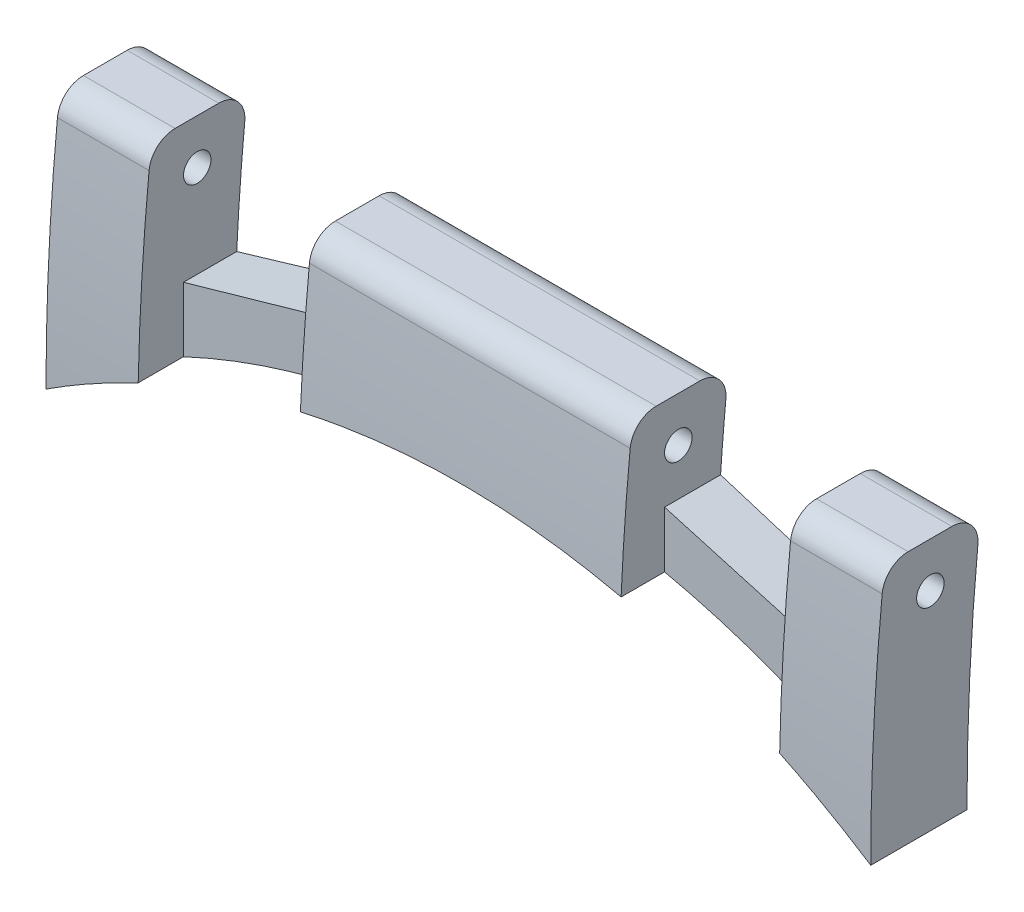
ISO-10303-21;
HEADER;
FILE_DESCRIPTION(('STEP AP214'),'2;1');
FILE_NAME('part.step','',(''),(''),'','','');
FILE_SCHEMA(('AUTOMOTIVE_DESIGN { 1 0 10303 214 1 1 1 1 }'));
ENDSEC;
DATA;
#1=APPLICATION_CONTEXT('core data for automotive mechanical design processes');
#2=APPLICATION_PROTOCOL_DEFINITION('international standard','automotive_design',2000,#1);
#3=PRODUCT_CONTEXT('',#1,'mechanical');
#4=PRODUCT('Part','Part','',(#3));
#5=PRODUCT_RELATED_PRODUCT_CATEGORY('part','',(#4));
#6=PRODUCT_DEFINITION_FORMATION('','',#4);
#7=PRODUCT_DEFINITION_CONTEXT('part definition',#1,'design');
#8=PRODUCT_DEFINITION('design','',#6,#7);
#9=PRODUCT_DEFINITION_SHAPE('','',#8);
#10=(LENGTH_UNIT() NAMED_UNIT(*) SI_UNIT(.MILLI.,.METRE.));
#11=(NAMED_UNIT(*) PLANE_ANGLE_UNIT() SI_UNIT($,.RADIAN.));
#12=(NAMED_UNIT(*) SI_UNIT($,.STERADIAN.) SOLID_ANGLE_UNIT());
#13=UNCERTAINTY_MEASURE_WITH_UNIT(LENGTH_MEASURE(1.E-05),#10,'distance_accuracy_value','');
#14=(GEOMETRIC_REPRESENTATION_CONTEXT(3) GLOBAL_UNCERTAINTY_ASSIGNED_CONTEXT((#13)) GLOBAL_UNIT_ASSIGNED_CONTEXT((#10,
#11,#12)) REPRESENTATION_CONTEXT('',''));
#15=CARTESIAN_POINT('',(0.,0.,0.));
#16=DIRECTION('',(0.,0.,1.));
#17=DIRECTION('',(1.,0.,0.));
#18=AXIS2_PLACEMENT_3D('',#15,#16,#17);
#19=CARTESIAN_POINT('',(12.5,5.99999999999999,5.));
#20=DIRECTION('',(-0.274721127897377,-0.961523947640823,0.));
#21=DIRECTION('',(0.961523947640823,-0.274721127897377,0.));
#22=AXIS2_PLACEMENT_3D('',#19,#20,#21);
#23=PLANE('',#22);
#24=DIRECTION('',(-0.961523947640823,0.274721127897377,0.));
#25=VECTOR('',#24,1.);
#26=CARTESIAN_POINT('',(12.5,5.99999999999999,2.1));
#27=LINE('',#26,#25);
#28=CARTESIAN_POINT('',(16.,5.,2.1));
#29=VERTEX_POINT('',#28);
#30=CARTESIAN_POINT('',(12.5,5.99999999999999,2.1));
#31=VERTEX_POINT('',#30);
#32=EDGE_CURVE('E192',#29,#31,#27,.T.);
#33=ORIENTED_EDGE('',*,*,#32,.F.);
#34=DIRECTION('',(0.,0.,-1.));
#35=VECTOR('',#34,1.);
#36=CARTESIAN_POINT('',(16.,5.,5.));
#37=LINE('',#36,#35);
#38=CARTESIAN_POINT('',(16.,5.,0.937460888595472));
#39=VERTEX_POINT('',#38);
#40=EDGE_CURVE('E211',#29,#39,#37,.T.);
#41=ORIENTED_EDGE('',*,*,#40,.T.);
#42=CARTESIAN_POINT('',(24.75,2.5,-49.));
#43=DIRECTION('',(-0.274721127897377,-0.961523947640823,0.));
#44=DIRECTION('',(-0.961523947640823,0.274721127897377,0.));
#45=AXIS2_PLACEMENT_3D('',#42,#43,#44);
#46=ELLIPSE('',#45,182.002747232014,50.);
#47=CARTESIAN_POINT('',(12.5,5.99999999999999,0.87734956871708));
#48=VERTEX_POINT('',#47);
#49=EDGE_CURVE('E210',#48,#39,#46,.F.);
#50=ORIENTED_EDGE('',*,*,#49,.F.);
#51=DIRECTION('',(0.,0.,-1.));
#52=VECTOR('',#51,1.);
#53=CARTESIAN_POINT('',(12.5,5.99999999999999,5.));
#54=LINE('',#53,#52);
#55=EDGE_CURVE('E205',#31,#48,#54,.T.);
#56=ORIENTED_EDGE('',*,*,#55,.F.);
#57=EDGE_LOOP('',(#33,#41,#50,#56));
#58=FACE_BOUND('',#57,.T.);
#59=ADVANCED_FACE('F36',(#58),#23,.F.);
#60=CARTESIAN_POINT('',(2.,5.,5.));
#61=DIRECTION('',(0.274721127897376,-0.961523947640824,0.));
#62=DIRECTION('',(0.961523947640824,0.274721127897376,0.));
#63=AXIS2_PLACEMENT_3D('',#60,#61,#62);
#64=PLANE('',#63);
#65=DIRECTION('',(-0.961523947640824,-0.274721127897376,0.));
#66=VECTOR('',#65,1.);
#67=CARTESIAN_POINT('',(2.,5.,2.1));
#68=LINE('',#67,#66);
#69=CARTESIAN_POINT('',(5.5,5.99999999999999,2.1));
#70=VERTEX_POINT('',#69);
#71=CARTESIAN_POINT('',(2.,5.,2.1));
#72=VERTEX_POINT('',#71);
#73=EDGE_CURVE('E499',#70,#72,#68,.T.);
#74=ORIENTED_EDGE('',*,*,#73,.F.);
#75=DIRECTION('',(0.,0.,-1.));
#76=VECTOR('',#75,1.);
#77=CARTESIAN_POINT('',(5.5,5.99999999999999,5.));
#78=LINE('',#77,#76);
#79=CARTESIAN_POINT('',(5.5,5.99999999999999,0.877349568717096));
#80=VERTEX_POINT('',#79);
#81=EDGE_CURVE('E438',#70,#80,#78,.T.);
#82=ORIENTED_EDGE('',*,*,#81,.T.);
#83=CARTESIAN_POINT('',(-6.75000000000007,2.5,-49.));
#84=DIRECTION('',(0.274721127897376,-0.961523947640824,0.));
#85=DIRECTION('',(-0.961523947640824,-0.274721127897376,0.));
#86=AXIS2_PLACEMENT_3D('',#83,#84,#85);
#87=ELLIPSE('',#86,182.002747232014,50.);
#88=CARTESIAN_POINT('',(2.,5.,0.937460888595469));
#89=VERTEX_POINT('',#88);
#90=EDGE_CURVE('E412',#89,#80,#87,.F.);
#91=ORIENTED_EDGE('',*,*,#90,.F.);
#92=DIRECTION('',(0.,0.,-1.));
#93=VECTOR('',#92,1.);
#94=CARTESIAN_POINT('',(2.,5.,5.));
#95=LINE('',#94,#93);
#96=EDGE_CURVE('E436',#72,#89,#95,.T.);
#97=ORIENTED_EDGE('',*,*,#96,.F.);
#98=EDGE_LOOP('',(#74,#82,#91,#97));
#99=FACE_BOUND('',#98,.T.);
#100=ADVANCED_FACE('F345',(#99),#64,.F.);
#101=CARTESIAN_POINT('',(18.,8.,5.));
#102=DIRECTION('',(-1.,0.,0.));
#103=DIRECTION('',(0.,-1.,0.));
#104=AXIS2_PLACEMENT_3D('',#101,#102,#103);
#105=PLANE('',#104);
#106=CARTESIAN_POINT('',(18.,7.02,1.79930708188843));
#107=DIRECTION('',(1.,0.,0.));
#108=DIRECTION('',(0.,0.,-1.));
#109=AXIS2_PLACEMENT_3D('',#106,#107,#108);
#110=CIRCLE('',#109,0.3);
#111=CARTESIAN_POINT('',(18.,7.02,1.49930708188843));
#112=VERTEX_POINT('',#111);
#113=EDGE_CURVE('E477',#112,#112,#110,.T.);
#114=ORIENTED_EDGE('',*,*,#113,.F.);
#115=EDGE_LOOP('',(#114));
#116=FACE_BOUND('',#115,.T.);
#117=DIRECTION('',(0.,0.,-1.));
#118=VECTOR('',#117,1.);
#119=CARTESIAN_POINT('',(18.,2.48042365578647,3.10000000000002));
#120=LINE('',#119,#118);
#121=CARTESIAN_POINT('',(18.,2.48042365578647,0.999996167667348));
#122=VERTEX_POINT('',#121);
#123=CARTESIAN_POINT('',(18.,2.48042365578647,3.09999616766735));
#124=VERTEX_POINT('',#123);
#125=EDGE_CURVE('E481',#122,#124,#120,.F.);
#126=ORIENTED_EDGE('',*,*,#125,.F.);
#127=CARTESIAN_POINT('',(18.,2.5,-49.));
#128=DIRECTION('',(-1.,0.,0.));
#129=DIRECTION('',(0.,-1.,0.));
#130=AXIS2_PLACEMENT_3D('',#127,#128,#129);
#131=CIRCLE('',#130,50.);
#132=CARTESIAN_POINT('',(18.,7.37443148111528,0.761831937097279));
#133=VERTEX_POINT('',#132);
#134=EDGE_CURVE('E430',#133,#122,#131,.F.);
#135=ORIENTED_EDGE('',*,*,#134,.F.);
#136=CARTESIAN_POINT('',(18.,7.43,1.32911682118018));
#137=DIRECTION('',(-1.,0.,0.));
#138=DIRECTION('',(0.,-1.,0.));
#139=AXIS2_PLACEMENT_3D('',#136,#137,#138);
#140=CIRCLE('',#139,0.57);
#141=CARTESIAN_POINT('',(18.,8.,1.32911682118018));
#142=VERTEX_POINT('',#141);
#143=EDGE_CURVE('E235',#133,#142,#140,.F.);
#144=ORIENTED_EDGE('',*,*,#143,.T.);
#145=DIRECTION('',(0.,0.,-1.));
#146=VECTOR('',#145,1.);
#147=CARTESIAN_POINT('',(18.,8.,5.));
#148=LINE('',#147,#146);
#149=CARTESIAN_POINT('',(18.,8.,2.28353382993135));
#150=VERTEX_POINT('',#149);
#151=EDGE_CURVE('E223',#150,#142,#148,.T.);
#152=ORIENTED_EDGE('',*,*,#151,.F.);
#153=CARTESIAN_POINT('',(18.,7.43,2.28353382993135));
#154=DIRECTION('',(-1.,0.,0.));
#155=DIRECTION('',(0.,-1.,0.));
#156=AXIS2_PLACEMENT_3D('',#153,#154,#155);
#157=CIRCLE('',#156,0.57);
#158=CARTESIAN_POINT('',(18.,7.48685009103783,2.85069171548791));
#159=VERTEX_POINT('',#158);
#160=EDGE_CURVE('E237',#150,#159,#157,.F.);
#161=ORIENTED_EDGE('',*,*,#160,.T.);
#162=CARTESIAN_POINT('',(18.,2.5,-46.9));
#163=DIRECTION('',(-1.,0.,0.));
#164=DIRECTION('',(0.,-1.,0.));
#165=AXIS2_PLACEMENT_3D('',#162,#163,#164);
#166=CIRCLE('',#165,50.);
#167=EDGE_CURVE('E410',#159,#124,#166,.F.);
#168=ORIENTED_EDGE('',*,*,#167,.T.);
#169=EDGE_LOOP('',(#126,#135,#144,#152,#161,#168));
#170=FACE_BOUND('',#169,.T.);
#171=ADVANCED_FACE('F348',(#116,#170),#105,.F.);
#172=CARTESIAN_POINT('',(16.,5.,5.));
#173=DIRECTION('',(1.,0.,0.));
#174=DIRECTION('',(0.,0.,-1.));
#175=AXIS2_PLACEMENT_3D('',#172,#173,#174);
#176=PLANE('',#175);
#177=CARTESIAN_POINT('',(16.,2.5,-46.9));
#178=DIRECTION('',(1.,0.,0.));
#179=DIRECTION('',(0.,0.,-1.));
#180=AXIS2_PLACEMENT_3D('',#177,#178,#179);
#181=CIRCLE('',#180,50.);
#182=CARTESIAN_POINT('',(16.,3.59265976733109,3.08805952057809));
#183=VERTEX_POINT('',#182);
#184=CARTESIAN_POINT('',(16.,7.48685009103783,2.85069171548791));
#185=VERTEX_POINT('',#184);
#186=EDGE_CURVE('E415',#183,#185,#181,.F.);
#187=ORIENTED_EDGE('',*,*,#186,.T.);
#188=CARTESIAN_POINT('',(16.,7.43,2.28353382993135));
#189=DIRECTION('',(1.,0.,0.));
#190=DIRECTION('',(0.,0.,-1.));
#191=AXIS2_PLACEMENT_3D('',#188,#189,#190);
#192=CIRCLE('',#191,0.57);
#193=CARTESIAN_POINT('',(16.,8.,2.28353382993135));
#194=VERTEX_POINT('',#193);
#195=EDGE_CURVE('E241',#185,#194,#192,.F.);
#196=ORIENTED_EDGE('',*,*,#195,.T.);
#197=DIRECTION('',(0.,0.,-1.));
#198=VECTOR('',#197,1.);
#199=CARTESIAN_POINT('',(16.,8.,5.));
#200=LINE('',#199,#198);
#201=CARTESIAN_POINT('',(16.,8.,1.32911682118018));
#202=VERTEX_POINT('',#201);
#203=EDGE_CURVE('E214',#194,#202,#200,.T.);
#204=ORIENTED_EDGE('',*,*,#203,.T.);
#205=CARTESIAN_POINT('',(16.,7.43,1.32911682118018));
#206=DIRECTION('',(1.,0.,0.));
#207=DIRECTION('',(0.,0.,-1.));
#208=AXIS2_PLACEMENT_3D('',#205,#206,#207);
#209=CIRCLE('',#208,0.57);
#210=CARTESIAN_POINT('',(16.,7.37443148111528,0.761831937097279));
#211=VERTEX_POINT('',#210);
#212=EDGE_CURVE('E239',#202,#211,#209,.F.);
#213=ORIENTED_EDGE('',*,*,#212,.T.);
#214=CARTESIAN_POINT('',(16.,2.5,-49.));
#215=DIRECTION('',(1.,0.,0.));
#216=DIRECTION('',(0.,0.,-1.));
#217=AXIS2_PLACEMENT_3D('',#214,#215,#216);
#218=CIRCLE('',#217,50.);
#219=EDGE_CURVE('E427',#39,#211,#218,.F.);
#220=ORIENTED_EDGE('',*,*,#219,.F.);
#221=ORIENTED_EDGE('',*,*,#40,.F.);
#222=DIRECTION('',(0.,1.,0.));
#223=VECTOR('',#222,1.);
#224=CARTESIAN_POINT('',(16.,6.68342568658216,2.1));
#225=LINE('',#224,#223);
#226=CARTESIAN_POINT('',(16.,3.59265976733109,2.1));
#227=VERTEX_POINT('',#226);
#228=EDGE_CURVE('E197',#227,#29,#225,.T.);
#229=ORIENTED_EDGE('',*,*,#228,.F.);
#230=DIRECTION('',(0.,0.,-1.));
#231=VECTOR('',#230,1.);
#232=CARTESIAN_POINT('',(16.,3.59265976733109,3.10000000000002));
#233=LINE('',#232,#231);
#234=EDGE_CURVE('E512',#183,#227,#233,.T.);
#235=ORIENTED_EDGE('',*,*,#234,.F.);
#236=EDGE_LOOP('',(#187,#196,#204,#213,#220,#221,#229,#235));
#237=FACE_BOUND('',#236,.T.);
#238=CARTESIAN_POINT('',(16.,7.02,1.79930708188843));
#239=DIRECTION('',(1.,0.,0.));
#240=DIRECTION('',(0.,0.,-1.));
#241=AXIS2_PLACEMENT_3D('',#238,#239,#240);
#242=CIRCLE('',#241,0.3);
#243=CARTESIAN_POINT('',(16.,7.02,1.49930708188843));
#244=VERTEX_POINT('',#243);
#245=EDGE_CURVE('E465',#244,#244,#242,.F.);
#246=ORIENTED_EDGE('',*,*,#245,.F.);
#247=EDGE_LOOP('',(#246));
#248=FACE_BOUND('',#247,.T.);
#249=ADVANCED_FACE('F359',(#237,#248),#176,.F.);
#250=CARTESIAN_POINT('',(12.5,7.99999999999999,5.));
#251=DIRECTION('',(-1.,0.,0.));
#252=DIRECTION('',(0.,-1.,0.));
#253=AXIS2_PLACEMENT_3D('',#250,#251,#252);
#254=PLANE('',#253);
#255=CARTESIAN_POINT('',(12.5,7.02,1.79930708188843));
#256=DIRECTION('',(-1.,0.,0.));
#257=DIRECTION('',(0.,-1.,0.));
#258=AXIS2_PLACEMENT_3D('',#255,#256,#257);
#259=CIRCLE('',#258,0.3);
#260=CARTESIAN_POINT('',(12.5,6.72,1.79930708188843));
#261=VERTEX_POINT('',#260);
#262=EDGE_CURVE('E468',#261,#261,#259,.F.);
#263=ORIENTED_EDGE('',*,*,#262,.F.);
#264=EDGE_LOOP('',(#263));
#265=FACE_BOUND('',#264,.T.);
#266=CARTESIAN_POINT('',(12.5,2.5,-46.9));
#267=DIRECTION('',(-1.,0.,0.));
#268=DIRECTION('',(0.,-1.,0.));
#269=AXIS2_PLACEMENT_3D('',#266,#267,#268);
#270=CIRCLE('',#269,50.);
#271=CARTESIAN_POINT('',(12.5,7.48685009103782,2.85069171548791));
#272=VERTEX_POINT('',#271);
#273=CARTESIAN_POINT('',(12.5,4.77562246644425,3.0481885796694));
#274=VERTEX_POINT('',#273);
#275=EDGE_CURVE('E451',#272,#274,#270,.F.);
#276=ORIENTED_EDGE('',*,*,#275,.T.);
#277=DIRECTION('',(0.,0.,-1.));
#278=VECTOR('',#277,1.);
#279=CARTESIAN_POINT('',(12.5,4.77562246644425,3.10000000000002));
#280=LINE('',#279,#278);
#281=CARTESIAN_POINT('',(12.5,4.77562246644425,2.1));
#282=VERTEX_POINT('',#281);
#283=EDGE_CURVE('E51',#282,#274,#280,.F.);
#284=ORIENTED_EDGE('',*,*,#283,.F.);
#285=DIRECTION('',(0.,-1.,0.));
#286=VECTOR('',#285,1.);
#287=CARTESIAN_POINT('',(12.5,6.68342568658216,2.1));
#288=LINE('',#287,#286);
#289=EDGE_CURVE('E195',#31,#282,#288,.T.);
#290=ORIENTED_EDGE('',*,*,#289,.F.);
#291=ORIENTED_EDGE('',*,*,#55,.T.);
#292=CARTESIAN_POINT('',(12.5,2.5,-49.));
#293=DIRECTION('',(-1.,0.,0.));
#294=DIRECTION('',(0.,-1.,0.));
#295=AXIS2_PLACEMENT_3D('',#292,#293,#294);
#296=CIRCLE('',#295,50.);
#297=CARTESIAN_POINT('',(12.5,7.37443148111528,0.761831937097279));
#298=VERTEX_POINT('',#297);
#299=EDGE_CURVE('E424',#298,#48,#296,.F.);
#300=ORIENTED_EDGE('',*,*,#299,.F.);
#301=CARTESIAN_POINT('',(12.5,7.42999999999999,1.32911682118018));
#302=DIRECTION('',(-1.,0.,0.));
#303=DIRECTION('',(0.,-1.,0.));
#304=AXIS2_PLACEMENT_3D('',#301,#302,#303);
#305=CIRCLE('',#304,0.57);
#306=CARTESIAN_POINT('',(12.5,7.99999999999999,1.32911682118018));
#307=VERTEX_POINT('',#306);
#308=EDGE_CURVE('E253',#298,#307,#305,.F.);
#309=ORIENTED_EDGE('',*,*,#308,.T.);
#310=DIRECTION('',(0.,0.,-1.));
#311=VECTOR('',#310,1.);
#312=CARTESIAN_POINT('',(12.5,7.99999999999999,5.));
#313=LINE('',#312,#311);
#314=CARTESIAN_POINT('',(12.5,7.99999999999999,2.28353382993135));
#315=VERTEX_POINT('',#314);
#316=EDGE_CURVE('E212',#315,#307,#313,.T.);
#317=ORIENTED_EDGE('',*,*,#316,.F.);
#318=CARTESIAN_POINT('',(12.5,7.42999999999999,2.28353382993135));
#319=DIRECTION('',(-1.,0.,0.));
#320=DIRECTION('',(0.,-1.,0.));
#321=AXIS2_PLACEMENT_3D('',#318,#319,#320);
#322=CIRCLE('',#321,0.57);
#323=EDGE_CURVE('E255',#315,#272,#322,.F.);
#324=ORIENTED_EDGE('',*,*,#323,.T.);
#325=EDGE_LOOP('',(#276,#284,#290,#291,#300,#309,#317,#324));
#326=FACE_BOUND('',#325,.T.);
#327=ADVANCED_FACE('F203',(#265,#326),#254,.F.);
#328=CARTESIAN_POINT('',(5.5,5.99999999999999,5.));
#329=DIRECTION('',(1.,0.,0.));
#330=DIRECTION('',(0.,0.,-1.));
#331=AXIS2_PLACEMENT_3D('',#328,#329,#330);
#332=PLANE('',#331);
#333=CARTESIAN_POINT('',(5.5,2.5,-46.9));
#334=DIRECTION('',(1.,0.,0.));
#335=DIRECTION('',(0.,0.,-1.));
#336=AXIS2_PLACEMENT_3D('',#333,#334,#335);
#337=CIRCLE('',#336,50.);
#338=CARTESIAN_POINT('',(5.5,4.77562246644425,3.0481885796694));
#339=VERTEX_POINT('',#338);
#340=CARTESIAN_POINT('',(5.5,7.48685009103782,2.85069171548791));
#341=VERTEX_POINT('',#340);
#342=EDGE_CURVE('E456',#339,#341,#337,.F.);
#343=ORIENTED_EDGE('',*,*,#342,.T.);
#344=CARTESIAN_POINT('',(5.5,7.42999999999999,2.28353382993135));
#345=DIRECTION('',(1.,0.,0.));
#346=DIRECTION('',(0.,0.,-1.));
#347=AXIS2_PLACEMENT_3D('',#344,#345,#346);
#348=CIRCLE('',#347,0.57);
#349=CARTESIAN_POINT('',(5.5,7.99999999999999,2.28353382993135));
#350=VERTEX_POINT('',#349);
#351=EDGE_CURVE('E248',#341,#350,#348,.F.);
#352=ORIENTED_EDGE('',*,*,#351,.T.);
#353=DIRECTION('',(0.,0.,-1.));
#354=VECTOR('',#353,1.);
#355=CARTESIAN_POINT('',(5.5,7.99999999999999,5.));
#356=LINE('',#355,#354);
#357=CARTESIAN_POINT('',(5.5,7.99999999999999,1.32911682118018));
#358=VERTEX_POINT('',#357);
#359=EDGE_CURVE('E217',#350,#358,#356,.T.);
#360=ORIENTED_EDGE('',*,*,#359,.T.);
#361=CARTESIAN_POINT('',(5.5,7.42999999999999,1.32911682118018));
#362=DIRECTION('',(1.,0.,0.));
#363=DIRECTION('',(0.,0.,-1.));
#364=AXIS2_PLACEMENT_3D('',#361,#362,#363);
#365=CIRCLE('',#364,0.57);
#366=CARTESIAN_POINT('',(5.5,7.37443148111528,0.761831937097279));
#367=VERTEX_POINT('',#366);
#368=EDGE_CURVE('E246',#358,#367,#365,.F.);
#369=ORIENTED_EDGE('',*,*,#368,.T.);
#370=CARTESIAN_POINT('',(5.5,2.5,-49.));
#371=DIRECTION('',(1.,0.,0.));
#372=DIRECTION('',(0.,0.,-1.));
#373=AXIS2_PLACEMENT_3D('',#370,#371,#372);
#374=CIRCLE('',#373,50.);
#375=EDGE_CURVE('E421',#80,#367,#374,.F.);
#376=ORIENTED_EDGE('',*,*,#375,.F.);
#377=ORIENTED_EDGE('',*,*,#81,.F.);
#378=DIRECTION('',(0.,1.,0.));
#379=VECTOR('',#378,1.);
#380=CARTESIAN_POINT('',(5.5,6.26999684878453,2.1));
#381=LINE('',#380,#379);
#382=CARTESIAN_POINT('',(5.5,4.77562246644425,2.1));
#383=VERTEX_POINT('',#382);
#384=EDGE_CURVE('E502',#383,#70,#381,.T.);
#385=ORIENTED_EDGE('',*,*,#384,.F.);
#386=DIRECTION('',(0.,0.,-1.));
#387=VECTOR('',#386,1.);
#388=CARTESIAN_POINT('',(5.5,4.77562246644425,3.10000000000002));
#389=LINE('',#388,#387);
#390=EDGE_CURVE('E503',#339,#383,#389,.T.);
#391=ORIENTED_EDGE('',*,*,#390,.F.);
#392=EDGE_LOOP('',(#343,#352,#360,#369,#376,#377,#385,#391));
#393=FACE_BOUND('',#392,.T.);
#394=CARTESIAN_POINT('',(5.5,7.02,1.79930708188843));
#395=DIRECTION('',(1.,0.,0.));
#396=DIRECTION('',(0.,0.,-1.));
#397=AXIS2_PLACEMENT_3D('',#394,#395,#396);
#398=CIRCLE('',#397,0.3);
#399=CARTESIAN_POINT('',(5.5,7.02,1.49930708188843));
#400=VERTEX_POINT('',#399);
#401=EDGE_CURVE('E471',#400,#400,#398,.F.);
#402=ORIENTED_EDGE('',*,*,#401,.F.);
#403=EDGE_LOOP('',(#402));
#404=FACE_BOUND('',#403,.T.);
#405=ADVANCED_FACE('F343',(#393,#404),#332,.F.);
#406=CARTESIAN_POINT('',(2.,8.,5.));
#407=DIRECTION('',(-1.,0.,0.));
#408=DIRECTION('',(0.,-1.,0.));
#409=AXIS2_PLACEMENT_3D('',#406,#407,#408);
#410=PLANE('',#409);
#411=CARTESIAN_POINT('',(2.,7.02,1.79930708188843));
#412=DIRECTION('',(-1.,0.,0.));
#413=DIRECTION('',(0.,-1.,0.));
#414=AXIS2_PLACEMENT_3D('',#411,#412,#413);
#415=CIRCLE('',#414,0.3);
#416=CARTESIAN_POINT('',(2.,6.72,1.79930708188843));
#417=VERTEX_POINT('',#416);
#418=EDGE_CURVE('E474',#417,#417,#415,.F.);
#419=ORIENTED_EDGE('',*,*,#418,.F.);
#420=EDGE_LOOP('',(#419));
#421=FACE_BOUND('',#420,.T.);
#422=CARTESIAN_POINT('',(2.,2.5,-46.9));
#423=DIRECTION('',(-1.,0.,0.));
#424=DIRECTION('',(0.,-1.,0.));
#425=AXIS2_PLACEMENT_3D('',#422,#423,#424);
#426=CIRCLE('',#425,50.);
#427=CARTESIAN_POINT('',(2.,7.48685009103783,2.85069171548791));
#428=VERTEX_POINT('',#427);
#429=CARTESIAN_POINT('',(2.,3.59265976733108,3.08805952057809));
#430=VERTEX_POINT('',#429);
#431=EDGE_CURVE('E458',#428,#430,#426,.F.);
#432=ORIENTED_EDGE('',*,*,#431,.T.);
#433=DIRECTION('',(0.,0.,-1.));
#434=VECTOR('',#433,1.);
#435=CARTESIAN_POINT('',(2.,3.59265976733108,3.10000000000002));
#436=LINE('',#435,#434);
#437=CARTESIAN_POINT('',(2.,3.59265976733108,2.1));
#438=VERTEX_POINT('',#437);
#439=EDGE_CURVE('E59',#438,#430,#436,.F.);
#440=ORIENTED_EDGE('',*,*,#439,.F.);
#441=DIRECTION('',(0.,-1.,0.));
#442=VECTOR('',#441,1.);
#443=CARTESIAN_POINT('',(2.,6.26999684878453,2.1));
#444=LINE('',#443,#442);
#445=EDGE_CURVE('E201',#72,#438,#444,.T.);
#446=ORIENTED_EDGE('',*,*,#445,.F.);
#447=ORIENTED_EDGE('',*,*,#96,.T.);
#448=CARTESIAN_POINT('',(2.,2.5,-49.));
#449=DIRECTION('',(-1.,0.,0.));
#450=DIRECTION('',(0.,-1.,0.));
#451=AXIS2_PLACEMENT_3D('',#448,#449,#450);
#452=CIRCLE('',#451,50.);
#453=CARTESIAN_POINT('',(2.,7.37443148111529,0.761831937097279));
#454=VERTEX_POINT('',#453);
#455=EDGE_CURVE('E409',#454,#89,#452,.F.);
#456=ORIENTED_EDGE('',*,*,#455,.F.);
#457=CARTESIAN_POINT('',(2.,7.43,1.32911682118018));
#458=DIRECTION('',(-1.,0.,0.));
#459=DIRECTION('',(0.,-1.,0.));
#460=AXIS2_PLACEMENT_3D('',#457,#458,#459);
#461=CIRCLE('',#460,0.57);
#462=CARTESIAN_POINT('',(2.,8.,1.32911682118018));
#463=VERTEX_POINT('',#462);
#464=EDGE_CURVE('E263',#454,#463,#461,.F.);
#465=ORIENTED_EDGE('',*,*,#464,.T.);
#466=DIRECTION('',(0.,0.,-1.));
#467=VECTOR('',#466,1.);
#468=CARTESIAN_POINT('',(2.,8.,5.));
#469=LINE('',#468,#467);
#470=CARTESIAN_POINT('',(2.,8.,2.28353382993135));
#471=VERTEX_POINT('',#470);
#472=EDGE_CURVE('E433',#471,#463,#469,.T.);
#473=ORIENTED_EDGE('',*,*,#472,.F.);
#474=CARTESIAN_POINT('',(2.,7.43,2.28353382993135));
#475=DIRECTION('',(-1.,0.,0.));
#476=DIRECTION('',(0.,-1.,0.));
#477=AXIS2_PLACEMENT_3D('',#474,#475,#476);
#478=CIRCLE('',#477,0.57);
#479=EDGE_CURVE('E265',#471,#428,#478,.F.);
#480=ORIENTED_EDGE('',*,*,#479,.T.);
#481=EDGE_LOOP('',(#432,#440,#446,#447,#456,#465,#473,#480));
#482=FACE_BOUND('',#481,.T.);
#483=ADVANCED_FACE('F333',(#421,#482),#410,.F.);
#484=CARTESIAN_POINT('',(0.,0.,5.));
#485=DIRECTION('',(1.,0.,0.));
#486=DIRECTION('',(0.,0.,-1.));
#487=AXIS2_PLACEMENT_3D('',#484,#485,#486);
#488=PLANE('',#487);
#489=CARTESIAN_POINT('',(0.,7.02,1.79930708188843));
#490=DIRECTION('',(1.,0.,0.));
#491=DIRECTION('',(0.,0.,-1.));
#492=AXIS2_PLACEMENT_3D('',#489,#490,#491);
#493=CIRCLE('',#492,0.3);
#494=CARTESIAN_POINT('',(0.,7.02,1.49930708188843));
#495=VERTEX_POINT('',#494);
#496=EDGE_CURVE('E478',#495,#495,#493,.T.);
#497=ORIENTED_EDGE('',*,*,#496,.T.);
#498=EDGE_LOOP('',(#497));
#499=FACE_BOUND('',#498,.T.);
#500=DIRECTION('',(0.,0.,-1.));
#501=VECTOR('',#500,1.);
#502=CARTESIAN_POINT('',(0.,2.48042365578648,3.10000000000002));
#503=LINE('',#502,#501);
#504=CARTESIAN_POINT('',(0.,2.48042365578648,3.10000000000002));
#505=VERTEX_POINT('',#504);
#506=CARTESIAN_POINT('',(0.,2.48042365578648,0.999996167667348));
#507=VERTEX_POINT('',#506);
#508=EDGE_CURVE('E323',#505,#507,#503,.T.);
#509=ORIENTED_EDGE('',*,*,#508,.F.);
#510=CARTESIAN_POINT('',(0.,2.5,-46.9));
#511=DIRECTION('',(1.,0.,0.));
#512=DIRECTION('',(0.,0.,-1.));
#513=AXIS2_PLACEMENT_3D('',#510,#511,#512);
#514=CIRCLE('',#513,50.);
#515=CARTESIAN_POINT('',(0.,7.48685009103783,2.85069171548791));
#516=VERTEX_POINT('',#515);
#517=EDGE_CURVE('E462',#516,#505,#514,.T.);
#518=ORIENTED_EDGE('',*,*,#517,.F.);
#519=CARTESIAN_POINT('',(0.,7.43,2.28353382993135));
#520=DIRECTION('',(1.,0.,0.));
#521=DIRECTION('',(0.,0.,-1.));
#522=AXIS2_PLACEMENT_3D('',#519,#520,#521);
#523=CIRCLE('',#522,0.57);
#524=CARTESIAN_POINT('',(0.,8.,2.28353382993135));
#525=VERTEX_POINT('',#524);
#526=EDGE_CURVE('E259',#516,#525,#523,.F.);
#527=ORIENTED_EDGE('',*,*,#526,.T.);
#528=DIRECTION('',(0.,0.,-1.));
#529=VECTOR('',#528,1.);
#530=CARTESIAN_POINT('',(0.,8.,5.));
#531=LINE('',#530,#529);
#532=CARTESIAN_POINT('',(0.,8.,1.32911682118018));
#533=VERTEX_POINT('',#532);
#534=EDGE_CURVE('E405',#525,#533,#531,.T.);
#535=ORIENTED_EDGE('',*,*,#534,.T.);
#536=CARTESIAN_POINT('',(0.,7.43,1.32911682118018));
#537=DIRECTION('',(1.,0.,0.));
#538=DIRECTION('',(0.,0.,-1.));
#539=AXIS2_PLACEMENT_3D('',#536,#537,#538);
#540=CIRCLE('',#539,0.57);
#541=CARTESIAN_POINT('',(0.,7.37443148111529,0.761831937097279));
#542=VERTEX_POINT('',#541);
#543=EDGE_CURVE('E257',#533,#542,#540,.F.);
#544=ORIENTED_EDGE('',*,*,#543,.T.);
#545=CARTESIAN_POINT('',(0.,2.5,-49.));
#546=DIRECTION('',(1.,0.,0.));
#547=DIRECTION('',(0.,0.,-1.));
#548=AXIS2_PLACEMENT_3D('',#545,#546,#547);
#549=CIRCLE('',#548,50.);
#550=EDGE_CURVE('E403',#542,#507,#549,.T.);
#551=ORIENTED_EDGE('',*,*,#550,.T.);
#552=EDGE_LOOP('',(#509,#518,#527,#535,#544,#551));
#553=FACE_BOUND('',#552,.T.);
#554=ADVANCED_FACE('F329',(#499,#553),#488,.F.);
#555=CARTESIAN_POINT('',(20.,2.5,-49.));
#556=DIRECTION('',(-1.,0.,0.));
#557=DIRECTION('',(0.,0.,1.));
#558=AXIS2_PLACEMENT_3D('',#555,#556,#557);
#559=CYLINDRICAL_SURFACE('',#558,50.);
#560=ORIENTED_EDGE('',*,*,#134,.T.);
#561=CARTESIAN_POINT('',(18.,2.48042365578647,0.999996167667348));
#562=CARTESIAN_POINT('',(17.8055525280563,2.60696817314094,1.00004474962335));
#563=CARTESIAN_POINT('',(17.6084600894763,2.72939557360817,0.999613365333557));
#564=CARTESIAN_POINT('',(17.209293397846,2.9658310213055,0.997969905377897));
#565=CARTESIAN_POINT('',(17.0072191825365,3.07983913229204,0.996757835624573));
#566=CARTESIAN_POINT('',(16.3940968708017,3.40889775385121,0.992220297305017));
#567=CARTESIAN_POINT('',(15.9760390745052,3.61105414294081,0.987993324775428));
#568=CARTESIAN_POINT('',(15.1247769086841,3.97925350663503,0.978452577156971));
#569=CARTESIAN_POINT('',(14.6915845534382,4.14532440344531,0.973139648580952));
#570=CARTESIAN_POINT('',(13.8127428318243,4.44041724947522,0.962551957906862));
#571=CARTESIAN_POINT('',(13.367093593561,4.56943957954295,0.957277195417));
#572=CARTESIAN_POINT('',(12.4663532932501,4.78955382934834,0.947673515084068));
#573=CARTESIAN_POINT('',(12.0112586816703,4.8806312083057,0.943344960136043));
#574=CARTESIAN_POINT('',(11.0949422653237,5.02413956193763,0.936298730416138));
#575=CARTESIAN_POINT('',(10.6337204707683,5.07657060101108,0.93358105295995));
#576=CARTESIAN_POINT('',(9.93987489442825,5.1259506067262,0.930998207351666));
#577=CARTESIAN_POINT('',(9.7082100134318,5.13753222382929,0.930386231592016));
#578=CARTESIAN_POINT('',(9.24465648423084,5.15092195996024,0.929677118818103));
#579=CARTESIAN_POINT('',(9.01276790838598,5.15273257718695,0.929579850206295));
#580=CARTESIAN_POINT('',(8.31727044915072,5.14349290061426,0.930072441989568));
#581=CARTESIAN_POINT('',(7.85377181917995,5.11777520006257,0.931446479535239));
#582=CARTESIAN_POINT('',(6.9307996270716,5.0274139274864,0.936100946397159));
#583=CARTESIAN_POINT('',(6.4713248761453,4.96278227457953,0.939380791964744));
#584=CARTESIAN_POINT('',(5.55939437916964,4.79505810162244,0.947369855728815));
#585=CARTESIAN_POINT('',(5.1069393867249,4.69196148152772,0.952079226290757));
#586=CARTESIAN_POINT('',(4.21271874053871,4.44814913961118,0.962181437946524));
#587=CARTESIAN_POINT('',(3.77094420771815,4.30746592611541,0.967573686315283));
#588=CARTESIAN_POINT('',(2.90095289008083,3.9894908691777,0.978061915995904));
#589=CARTESIAN_POINT('',(2.47273062948664,3.81221403488617,0.983158017679799));
#590=CARTESIAN_POINT('',(1.69736692651268,3.4522908238096,0.991203228222641));
#591=CARTESIAN_POINT('',(1.34788632825311,3.27466569651823,0.994362018771911));
#592=CARTESIAN_POINT('',(0.66309419886048,2.89537213345641,0.998792810782659));
#593=CARTESIAN_POINT('',(0.327756675654057,2.69375066175725,1.00006843431287));
#594=CARTESIAN_POINT('',(0.,2.48042365578648,0.999996167667347));
#595=B_SPLINE_CURVE_WITH_KNOTS('',3,(#561,#562,#563,#564,#565,#566,#567,#568,#569,#570,#571,
#572,#573,#574,#575,#576,#577,#578,#579,#580,#581,#582,#583,#584,#585,#586,#587,#588,#589,#590,
#591,#592,#593,#594),.UNSPECIFIED.,.F.,.F.,(4,2,2,2,2,2,2,2,2,2,2,2,2,2,2,2,4),(0.,
0.695886204991912,1.39176713973127,2.78313646133426,4.17342530576349,5.56369985792993,
6.95450668443573,8.34531119334553,9.04099780264123,9.73650653394246,11.1273500738975,
12.517767823118,13.9083338216291,15.297701003063,16.6864994533284,17.8616536493111,
19.034544604623),.UNSPECIFIED.);
#596=EDGE_CURVE('E317',#122,#507,#595,.T.);
#597=ORIENTED_EDGE('',*,*,#596,.T.);
#598=ORIENTED_EDGE('',*,*,#550,.F.);
#599=DIRECTION('',(-1.,0.,0.));
#600=VECTOR('',#599,1.);
#601=CARTESIAN_POINT('',(20.,7.37443148111529,0.761831937097279));
#602=LINE('',#601,#600);
#603=EDGE_CURVE('E229',#542,#454,#602,.F.);
#604=ORIENTED_EDGE('',*,*,#603,.T.);
#605=ORIENTED_EDGE('',*,*,#455,.T.);
#606=ORIENTED_EDGE('',*,*,#90,.T.);
#607=ORIENTED_EDGE('',*,*,#375,.T.);
#608=DIRECTION('',(-1.,0.,0.));
#609=VECTOR('',#608,1.);
#610=CARTESIAN_POINT('',(20.,7.37443148111528,0.761831937097279));
#611=LINE('',#610,#609);
#612=EDGE_CURVE('E226',#367,#298,#611,.F.);
#613=ORIENTED_EDGE('',*,*,#612,.T.);
#614=ORIENTED_EDGE('',*,*,#299,.T.);
#615=ORIENTED_EDGE('',*,*,#49,.T.);
#616=ORIENTED_EDGE('',*,*,#219,.T.);
#617=DIRECTION('',(-1.,0.,0.));
#618=VECTOR('',#617,1.);
#619=CARTESIAN_POINT('',(20.,7.37443148111528,0.761831937097279));
#620=LINE('',#619,#618);
#621=EDGE_CURVE('E232',#211,#133,#620,.F.);
#622=ORIENTED_EDGE('',*,*,#621,.T.);
#623=EDGE_LOOP('',(#560,#597,#598,#604,#605,#606,#607,#613,#614,#615,#616,#622));
#624=FACE_BOUND('',#623,.T.);
#625=ADVANCED_FACE('F325',(#624),#559,.F.);
#626=CARTESIAN_POINT('',(20.,2.5,-46.9));
#627=DIRECTION('',(-1.,0.,0.));
#628=DIRECTION('',(0.,0.,1.));
#629=AXIS2_PLACEMENT_3D('',#626,#627,#628);
#630=CYLINDRICAL_SURFACE('',#629,50.);
#631=CARTESIAN_POINT('',(9.,-11.3488930301529,3.10000000000002));
#632=DIRECTION('',(0.,0.,1.));
#633=DIRECTION('',(1.,0.,0.));
#634=AXIS2_PLACEMENT_3D('',#631,#632,#633);
#635=CIRCLE('',#634,16.5);
#636=CARTESIAN_POINT('',(0.0301526300954397,2.5,3.10000000000002));
#637=VERTEX_POINT('',#636);
#638=EDGE_CURVE('E486',#637,#505,#635,.T.);
#639=ORIENTED_EDGE('',*,*,#638,.F.);
#640=CARTESIAN_POINT('',(2.,3.59265976733108,3.08805952057809));
#641=CARTESIAN_POINT('',(1.82706778990319,3.51164385259903,3.08982970785291));
#642=CARTESIAN_POINT('',(1.65554206357303,3.42762275244102,3.09146992266852));
#643=CARTESIAN_POINT('',(1.3157132297486,3.25378165637782,3.0943934740299));
#644=CARTESIAN_POINT('',(1.14740647902352,3.16396878944835,3.0956772393676));
#645=CARTESIAN_POINT('',(0.814006284794775,2.97855928631924,3.09779569559995));
#646=CARTESIAN_POINT('',(0.648912843257458,2.88296264658042,3.09863038621979));
#647=CARTESIAN_POINT('',(0.321940268196172,2.68598361803433,3.09975110134771));
#648=CARTESIAN_POINT('',(0.160065264553573,2.58459437019304,3.10003646092214));
#649=CARTESIAN_POINT('',(0.,2.48042365578648,3.09999616766734));
#650=B_SPLINE_CURVE_WITH_KNOTS('',3,(#640,#641,#642,#643,#644,#645,#646,#647,#648,#649),
.UNSPECIFIED.,.F.,.F.,(4,2,2,2,4),(0.,0.572902634677269,1.14511307881541,1.71732387310206,
2.29022686120703),.UNSPECIFIED.);
#651=EDGE_CURVE('E312',#430,#637,#650,.T.);
#652=ORIENTED_EDGE('',*,*,#651,.F.);
#653=ORIENTED_EDGE('',*,*,#431,.F.);
#654=DIRECTION('',(-1.,0.,0.));
#655=VECTOR('',#654,1.);
#656=CARTESIAN_POINT('',(20.,7.48685009103783,2.85069171548792));
#657=LINE('',#656,#655);
#658=EDGE_CURVE('E261',#428,#516,#657,.T.);
#659=ORIENTED_EDGE('',*,*,#658,.T.);
#660=ORIENTED_EDGE('',*,*,#517,.T.);
#661=EDGE_LOOP('',(#639,#652,#653,#659,#660));
#662=FACE_BOUND('',#661,.T.);
#663=ADVANCED_FACE('F288',(#662),#630,.T.);
#664=CARTESIAN_POINT('',(12.5,4.77562246644425,3.0481885796694));
#665=CARTESIAN_POINT('',(12.2715898967265,4.82520086790709,3.04592768272153));
#666=CARTESIAN_POINT('',(12.0421540115275,4.86992003624698,3.0438187543112));
#667=CARTESIAN_POINT('',(11.5815848330285,4.94957486924442,3.03997607177165));
#668=CARTESIAN_POINT('',(11.3504515234401,4.98451043989231,3.0382423212475));
#669=CARTESIAN_POINT('',(10.6549028363303,5.07456109536269,3.03370984073153));
#670=CARTESIAN_POINT('',(10.1884775618447,5.11488999518306,3.03158133848535));
#671=CARTESIAN_POINT('',(9.26221853524921,5.15542284307474,3.02944110931995));
#672=CARTESIAN_POINT('',(8.80241381480037,5.15632270772583,3.0293926699095));
#673=CARTESIAN_POINT('',(7.88456268908756,5.11975921133848,3.03132513082515));
#674=CARTESIAN_POINT('',(7.42651533816386,5.08232068769206,3.03330471730205));
#675=CARTESIAN_POINT('',(6.72463308152188,4.99535233146464,3.0377021249875));
#676=CARTESIAN_POINT('',(6.47905297714034,4.95927720300159,3.03950089978761));
#677=CARTESIAN_POINT('',(5.98858537616835,4.87588889215455,3.04353654052503));
#678=CARTESIAN_POINT('',(5.7437070231311,4.82852202635716,3.04577548995233));
#679=CARTESIAN_POINT('',(5.5,4.77562246644425,3.0481885796694));
#680=B_SPLINE_CURVE_WITH_KNOTS('',3,(#664,#665,#666,#667,#668,#669,#670,#671,#672,#673,#674,
#675,#676,#677,#678,#679),.UNSPECIFIED.,.F.,.F.,(4,2,2,2,2,2,2,4),(0.,0.701107130656889,
1.40222099795381,2.80487364382588,4.18275952023236,5.55975330243177,6.30419708247892,
7.05225329025922),.UNSPECIFIED.);
#681=EDGE_CURVE('E305',#274,#339,#680,.T.);
#682=ORIENTED_EDGE('',*,*,#681,.F.);
#683=ORIENTED_EDGE('',*,*,#275,.F.);
#684=DIRECTION('',(-1.,0.,0.));
#685=VECTOR('',#684,1.);
#686=CARTESIAN_POINT('',(20.,7.48685009103782,2.85069171548792));
#687=LINE('',#686,#685);
#688=EDGE_CURVE('E250',#272,#341,#687,.T.);
#689=ORIENTED_EDGE('',*,*,#688,.T.);
#690=ORIENTED_EDGE('',*,*,#342,.F.);
#691=EDGE_LOOP('',(#682,#683,#689,#690));
#692=FACE_BOUND('',#691,.T.);
#693=ADVANCED_FACE('F454',(#692),#630,.T.);
#694=CARTESIAN_POINT('',(18.,2.48042365578647,3.09999616766735));
#695=CARTESIAN_POINT('',(17.8399347354464,2.58459437019303,3.10003646092214));
#696=CARTESIAN_POINT('',(17.6780597318038,2.68598361803432,3.09975110134771));
#697=CARTESIAN_POINT('',(17.3510871567425,2.88296264658042,3.09863038621979));
#698=CARTESIAN_POINT('',(17.1859937152052,2.97855928631924,3.09779569559995));
#699=CARTESIAN_POINT('',(16.8525935209765,3.16396878944835,3.0956772393676));
#700=CARTESIAN_POINT('',(16.6842867702514,3.25378165637782,3.0943934740299));
#701=CARTESIAN_POINT('',(16.344457936427,3.42762275244102,3.09146992266852));
#702=CARTESIAN_POINT('',(16.1729322100968,3.51164385259903,3.08982970785291));
#703=CARTESIAN_POINT('',(16.,3.59265976733108,3.08805952057809));
#704=B_SPLINE_CURVE_WITH_KNOTS('',3,(#694,#695,#696,#697,#698,#699,#700,#701,#702,#703),
.UNSPECIFIED.,.F.,.F.,(4,2,2,2,4),(0.,0.572902988104978,1.14511378239163,1.71732422652978,
2.29022686120705),.UNSPECIFIED.);
#705=CARTESIAN_POINT('',(17.9698473699046,2.5,3.10000000000002));
#706=VERTEX_POINT('',#705);
#707=EDGE_CURVE('E282',#706,#183,#704,.T.);
#708=ORIENTED_EDGE('',*,*,#707,.F.);
#709=EDGE_CURVE('E510',#124,#706,#635,.T.);
#710=ORIENTED_EDGE('',*,*,#709,.F.);
#711=ORIENTED_EDGE('',*,*,#167,.F.);
#712=DIRECTION('',(-1.,0.,0.));
#713=VECTOR('',#712,1.);
#714=CARTESIAN_POINT('',(20.,7.48685009103783,2.85069171548792));
#715=LINE('',#714,#713);
#716=EDGE_CURVE('E243',#159,#185,#715,.T.);
#717=ORIENTED_EDGE('',*,*,#716,.T.);
#718=ORIENTED_EDGE('',*,*,#186,.F.);
#719=EDGE_LOOP('',(#708,#710,#711,#717,#718));
#720=FACE_BOUND('',#719,.T.);
#721=ADVANCED_FACE('F368',(#720),#630,.T.);
#722=CARTESIAN_POINT('',(16.,8.,5.));
#723=DIRECTION('',(0.,-1.,0.));
#724=DIRECTION('',(0.,0.,-1.));
#725=AXIS2_PLACEMENT_3D('',#722,#723,#724);
#726=PLANE('',#725);
#727=ORIENTED_EDGE('',*,*,#203,.F.);
#728=DIRECTION('',(-1.,0.,0.));
#729=VECTOR('',#728,1.);
#730=CARTESIAN_POINT('',(16.,8.,2.28353382993135));
#731=LINE('',#730,#729);
#732=EDGE_CURVE('E269',#194,#150,#731,.F.);
#733=ORIENTED_EDGE('',*,*,#732,.T.);
#734=ORIENTED_EDGE('',*,*,#151,.T.);
#735=DIRECTION('',(1.,0.,0.));
#736=VECTOR('',#735,1.);
#737=CARTESIAN_POINT('',(16.,8.,1.32911682118018));
#738=LINE('',#737,#736);
#739=EDGE_CURVE('E267',#142,#202,#738,.F.);
#740=ORIENTED_EDGE('',*,*,#739,.T.);
#741=EDGE_LOOP('',(#727,#733,#734,#740));
#742=FACE_BOUND('',#741,.T.);
#743=ADVANCED_FACE('F355',(#742),#726,.F.);
#744=CARTESIAN_POINT('',(5.5,7.99999999999999,5.));
#745=DIRECTION('',(0.,-1.,0.));
#746=DIRECTION('',(0.,0.,-1.));
#747=AXIS2_PLACEMENT_3D('',#744,#745,#746);
#748=PLANE('',#747);
#749=ORIENTED_EDGE('',*,*,#359,.F.);
#750=DIRECTION('',(-1.,0.,0.));
#751=VECTOR('',#750,1.);
#752=CARTESIAN_POINT('',(5.5,7.99999999999999,2.28353382993135));
#753=LINE('',#752,#751);
#754=EDGE_CURVE('E274',#350,#315,#753,.F.);
#755=ORIENTED_EDGE('',*,*,#754,.T.);
#756=ORIENTED_EDGE('',*,*,#316,.T.);
#757=DIRECTION('',(1.,0.,0.));
#758=VECTOR('',#757,1.);
#759=CARTESIAN_POINT('',(5.5,7.99999999999999,1.32911682118018));
#760=LINE('',#759,#758);
#761=EDGE_CURVE('E272',#307,#358,#760,.F.);
#762=ORIENTED_EDGE('',*,*,#761,.T.);
#763=EDGE_LOOP('',(#749,#755,#756,#762));
#764=FACE_BOUND('',#763,.T.);
#765=ADVANCED_FACE('F339',(#764),#748,.F.);
#766=CARTESIAN_POINT('',(0.,8.,5.));
#767=DIRECTION('',(0.,-1.,0.));
#768=DIRECTION('',(0.,0.,-1.));
#769=AXIS2_PLACEMENT_3D('',#766,#767,#768);
#770=PLANE('',#769);
#771=ORIENTED_EDGE('',*,*,#534,.F.);
#772=DIRECTION('',(-1.,0.,0.));
#773=VECTOR('',#772,1.);
#774=CARTESIAN_POINT('',(0.,8.,2.28353382993135));
#775=LINE('',#774,#773);
#776=EDGE_CURVE('E279',#525,#471,#775,.F.);
#777=ORIENTED_EDGE('',*,*,#776,.T.);
#778=ORIENTED_EDGE('',*,*,#472,.T.);
#779=DIRECTION('',(1.,0.,0.));
#780=VECTOR('',#779,1.);
#781=CARTESIAN_POINT('',(0.,8.,1.32911682118018));
#782=LINE('',#781,#780);
#783=EDGE_CURVE('E277',#463,#533,#782,.F.);
#784=ORIENTED_EDGE('',*,*,#783,.T.);
#785=EDGE_LOOP('',(#771,#777,#778,#784));
#786=FACE_BOUND('',#785,.T.);
#787=ADVANCED_FACE('F335',(#786),#770,.F.);
#788=CARTESIAN_POINT('',(18.,7.02,1.79930708188843));
#789=DIRECTION('',(-1.,0.,0.));
#790=DIRECTION('',(0.,0.,1.));
#791=AXIS2_PLACEMENT_3D('',#788,#789,#790);
#792=CYLINDRICAL_SURFACE('',#791,0.3);
#793=ORIENTED_EDGE('',*,*,#496,.F.);
#794=EDGE_LOOP('',(#793));
#795=FACE_BOUND('',#794,.T.);
#796=ORIENTED_EDGE('',*,*,#418,.T.);
#797=EDGE_LOOP('',(#796));
#798=FACE_BOUND('',#797,.T.);
#799=ADVANCED_FACE('F338',(#795,#798),#792,.F.);
#800=ORIENTED_EDGE('',*,*,#401,.T.);
#801=EDGE_LOOP('',(#800));
#802=FACE_BOUND('',#801,.T.);
#803=ORIENTED_EDGE('',*,*,#262,.T.);
#804=EDGE_LOOP('',(#803));
#805=FACE_BOUND('',#804,.T.);
#806=ADVANCED_FACE('F695',(#802,#805),#792,.F.);
#807=ORIENTED_EDGE('',*,*,#113,.T.);
#808=EDGE_LOOP('',(#807));
#809=FACE_BOUND('',#808,.T.);
#810=ORIENTED_EDGE('',*,*,#245,.T.);
#811=EDGE_LOOP('',(#810));
#812=FACE_BOUND('',#811,.T.);
#813=ADVANCED_FACE('F299',(#809,#812),#792,.F.);
#814=CARTESIAN_POINT('',(20.,7.43,2.28353382993135));
#815=DIRECTION('',(-1.,0.,0.));
#816=DIRECTION('',(0.,0.,1.));
#817=AXIS2_PLACEMENT_3D('',#814,#815,#816);
#818=CYLINDRICAL_SURFACE('',#817,0.57);
#819=ORIENTED_EDGE('',*,*,#195,.F.);
#820=ORIENTED_EDGE('',*,*,#716,.F.);
#821=ORIENTED_EDGE('',*,*,#160,.F.);
#822=ORIENTED_EDGE('',*,*,#732,.F.);
#823=EDGE_LOOP('',(#819,#820,#821,#822));
#824=FACE_BOUND('',#823,.T.);
#825=ADVANCED_FACE('F373',(#824),#818,.T.);
#826=CARTESIAN_POINT('',(20.,7.43,1.32911682118018));
#827=DIRECTION('',(-1.,0.,0.));
#828=DIRECTION('',(0.,0.,1.));
#829=AXIS2_PLACEMENT_3D('',#826,#827,#828);
#830=CYLINDRICAL_SURFACE('',#829,0.57);
#831=ORIENTED_EDGE('',*,*,#212,.F.);
#832=ORIENTED_EDGE('',*,*,#739,.F.);
#833=ORIENTED_EDGE('',*,*,#143,.F.);
#834=ORIENTED_EDGE('',*,*,#621,.F.);
#835=EDGE_LOOP('',(#831,#832,#833,#834));
#836=FACE_BOUND('',#835,.T.);
#837=ADVANCED_FACE('F376',(#836),#830,.T.);
#838=CARTESIAN_POINT('',(20.,7.42999999999999,2.28353382993135));
#839=DIRECTION('',(-1.,0.,0.));
#840=DIRECTION('',(0.,0.,1.));
#841=AXIS2_PLACEMENT_3D('',#838,#839,#840);
#842=CYLINDRICAL_SURFACE('',#841,0.57);
#843=ORIENTED_EDGE('',*,*,#351,.F.);
#844=ORIENTED_EDGE('',*,*,#688,.F.);
#845=ORIENTED_EDGE('',*,*,#323,.F.);
#846=ORIENTED_EDGE('',*,*,#754,.F.);
#847=EDGE_LOOP('',(#843,#844,#845,#846));
#848=FACE_BOUND('',#847,.T.);
#849=ADVANCED_FACE('F380',(#848),#842,.T.);
#850=CARTESIAN_POINT('',(20.,7.43,2.28353382993135));
#851=DIRECTION('',(-1.,0.,0.));
#852=DIRECTION('',(0.,0.,1.));
#853=AXIS2_PLACEMENT_3D('',#850,#851,#852);
#854=CYLINDRICAL_SURFACE('',#853,0.57);
#855=ORIENTED_EDGE('',*,*,#526,.F.);
#856=ORIENTED_EDGE('',*,*,#658,.F.);
#857=ORIENTED_EDGE('',*,*,#479,.F.);
#858=ORIENTED_EDGE('',*,*,#776,.F.);
#859=EDGE_LOOP('',(#855,#856,#857,#858));
#860=FACE_BOUND('',#859,.T.);
#861=ADVANCED_FACE('F384',(#860),#854,.T.);
#862=CARTESIAN_POINT('',(20.,7.43,1.32911682118018));
#863=DIRECTION('',(-1.,0.,0.));
#864=DIRECTION('',(0.,0.,1.));
#865=AXIS2_PLACEMENT_3D('',#862,#863,#864);
#866=CYLINDRICAL_SURFACE('',#865,0.57);
#867=ORIENTED_EDGE('',*,*,#543,.F.);
#868=ORIENTED_EDGE('',*,*,#783,.F.);
#869=ORIENTED_EDGE('',*,*,#464,.F.);
#870=ORIENTED_EDGE('',*,*,#603,.F.);
#871=EDGE_LOOP('',(#867,#868,#869,#870));
#872=FACE_BOUND('',#871,.T.);
#873=ADVANCED_FACE('F387',(#872),#866,.T.);
#874=CARTESIAN_POINT('',(20.,7.42999999999999,1.32911682118018));
#875=DIRECTION('',(-1.,0.,0.));
#876=DIRECTION('',(0.,0.,1.));
#877=AXIS2_PLACEMENT_3D('',#874,#875,#876);
#878=CYLINDRICAL_SURFACE('',#877,0.57);
#879=ORIENTED_EDGE('',*,*,#368,.F.);
#880=ORIENTED_EDGE('',*,*,#761,.F.);
#881=ORIENTED_EDGE('',*,*,#308,.F.);
#882=ORIENTED_EDGE('',*,*,#612,.F.);
#883=EDGE_LOOP('',(#879,#880,#881,#882));
#884=FACE_BOUND('',#883,.T.);
#885=ADVANCED_FACE('F38',(#884),#878,.T.);
#886=CARTESIAN_POINT('',(9.,-11.3488930301529,3.10000000000002));
#887=DIRECTION('',(0.,0.,-1.));
#888=DIRECTION('',(-1.,0.,0.));
#889=AXIS2_PLACEMENT_3D('',#886,#887,#888);
#890=CYLINDRICAL_SURFACE('',#889,16.5);
#891=CARTESIAN_POINT('',(9.,-11.3488930301529,2.1));
#892=DIRECTION('',(0.,0.,1.));
#893=DIRECTION('',(1.,0.,0.));
#894=AXIS2_PLACEMENT_3D('',#891,#892,#893);
#895=CIRCLE('',#894,16.5);
#896=EDGE_CURVE('E12',#227,#282,#895,.T.);
#897=ORIENTED_EDGE('',*,*,#896,.T.);
#898=ORIENTED_EDGE('',*,*,#283,.T.);
#899=ORIENTED_EDGE('',*,*,#681,.T.);
#900=ORIENTED_EDGE('',*,*,#390,.T.);
#901=CARTESIAN_POINT('',(9.,-11.3488930301529,2.1));
#902=DIRECTION('',(0.,0.,1.));
#903=DIRECTION('',(1.,0.,0.));
#904=AXIS2_PLACEMENT_3D('',#901,#902,#903);
#905=CIRCLE('',#904,16.5);
#906=EDGE_CURVE('E44',#383,#438,#905,.T.);
#907=ORIENTED_EDGE('',*,*,#906,.T.);
#908=ORIENTED_EDGE('',*,*,#439,.T.);
#909=ORIENTED_EDGE('',*,*,#651,.T.);
#910=ORIENTED_EDGE('',*,*,#638,.T.);
#911=ORIENTED_EDGE('',*,*,#508,.T.);
#912=ORIENTED_EDGE('',*,*,#596,.F.);
#913=ORIENTED_EDGE('',*,*,#125,.T.);
#914=ORIENTED_EDGE('',*,*,#709,.T.);
#915=ORIENTED_EDGE('',*,*,#707,.T.);
#916=ORIENTED_EDGE('',*,*,#234,.T.);
#917=EDGE_LOOP('',(#897,#898,#899,#900,#907,#908,#909,#910,#911,#912,#913,#914,#915,#916));
#918=FACE_BOUND('',#917,.T.);
#919=ADVANCED_FACE('F292',(#918),#890,.F.);
#920=CARTESIAN_POINT('',(2.,2.09869503380482,2.1));
#921=DIRECTION('',(0.,0.,1.));
#922=DIRECTION('',(1.,0.,0.));
#923=AXIS2_PLACEMENT_3D('',#920,#921,#922);
#924=PLANE('',#923);
#925=ORIENTED_EDGE('',*,*,#73,.T.);
#926=ORIENTED_EDGE('',*,*,#445,.T.);
#927=ORIENTED_EDGE('',*,*,#906,.F.);
#928=ORIENTED_EDGE('',*,*,#384,.T.);
#929=EDGE_LOOP('',(#925,#926,#927,#928));
#930=FACE_BOUND('',#929,.T.);
#931=ADVANCED_FACE('F296',(#930),#924,.T.);
#932=CARTESIAN_POINT('',(12.5,2.09869503380482,2.1));
#933=DIRECTION('',(0.,0.,1.));
#934=DIRECTION('',(1.,0.,0.));
#935=AXIS2_PLACEMENT_3D('',#932,#933,#934);
#936=PLANE('',#935);
#937=ORIENTED_EDGE('',*,*,#32,.T.);
#938=ORIENTED_EDGE('',*,*,#289,.T.);
#939=ORIENTED_EDGE('',*,*,#896,.F.);
#940=ORIENTED_EDGE('',*,*,#228,.T.);
#941=EDGE_LOOP('',(#937,#938,#939,#940));
#942=FACE_BOUND('',#941,.T.);
#943=ADVANCED_FACE('F193',(#942),#936,.T.);
#944=CLOSED_SHELL('',(#59,#100,#171,#249,#327,#405,#483,#554,#625,#663,#693,#721,#743,#765,#787,
#799,#806,#813,#825,#837,#849,#861,#873,#885,#919,#931,#943));
#945=MANIFOLD_SOLID_BREP('B2',#944);
#946=ADVANCED_BREP_SHAPE_REPRESENTATION('',(#18,#945),#14);
#947=SHAPE_DEFINITION_REPRESENTATION(#9,#946);
ENDSEC;
END-ISO-10303-21;
